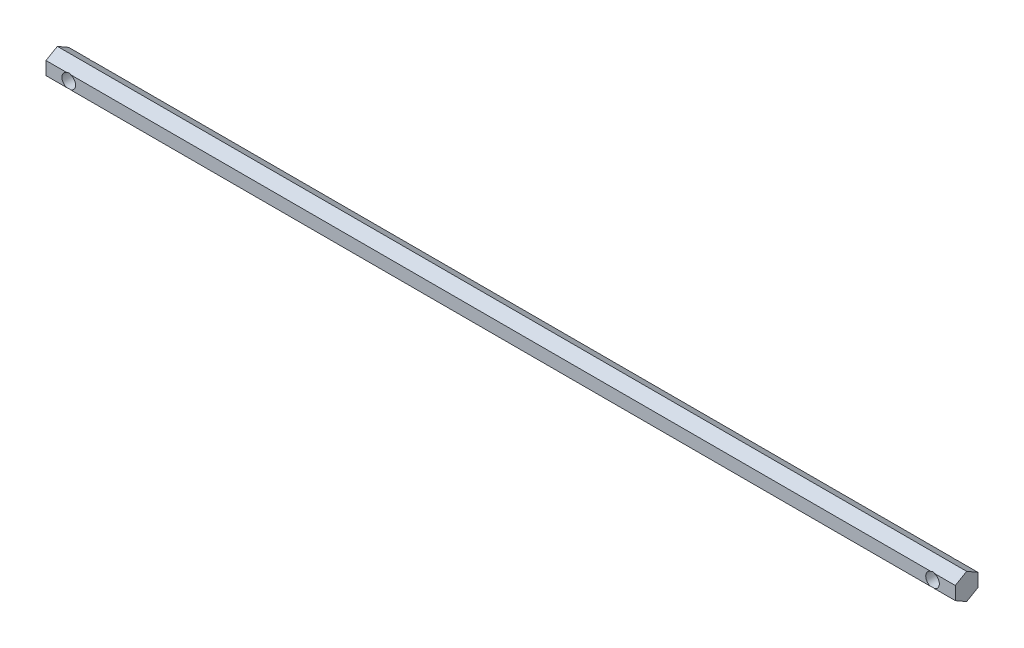
ISO-10303-21;
HEADER;
FILE_DESCRIPTION(('STEP AP214'),'2;1');
FILE_NAME('part.step','',(''),(''),'','','');
FILE_SCHEMA(('AUTOMOTIVE_DESIGN { 1 0 10303 214 1 1 1 1 }'));
ENDSEC;
DATA;
#1=APPLICATION_CONTEXT('core data for automotive mechanical design processes');
#2=APPLICATION_PROTOCOL_DEFINITION('international standard','automotive_design',2000,#1);
#3=PRODUCT_CONTEXT('',#1,'mechanical');
#4=PRODUCT('Part','Part','',(#3));
#5=PRODUCT_RELATED_PRODUCT_CATEGORY('part','',(#4));
#6=PRODUCT_DEFINITION_FORMATION('','',#4);
#7=PRODUCT_DEFINITION_CONTEXT('part definition',#1,'design');
#8=PRODUCT_DEFINITION('design','',#6,#7);
#9=PRODUCT_DEFINITION_SHAPE('','',#8);
#10=(LENGTH_UNIT() NAMED_UNIT(*) SI_UNIT(.MILLI.,.METRE.));
#11=(NAMED_UNIT(*) PLANE_ANGLE_UNIT() SI_UNIT($,.RADIAN.));
#12=(NAMED_UNIT(*) SI_UNIT($,.STERADIAN.) SOLID_ANGLE_UNIT());
#13=UNCERTAINTY_MEASURE_WITH_UNIT(LENGTH_MEASURE(1.E-05),#10,'distance_accuracy_value','');
#14=(GEOMETRIC_REPRESENTATION_CONTEXT(3) GLOBAL_UNCERTAINTY_ASSIGNED_CONTEXT((#13)) GLOBAL_UNIT_ASSIGNED_CONTEXT((#10,
#11,#12)) REPRESENTATION_CONTEXT('',''));
#15=CARTESIAN_POINT('',(0.,0.,0.));
#16=DIRECTION('',(0.,0.,1.));
#17=DIRECTION('',(1.,0.,0.));
#18=AXIS2_PLACEMENT_3D('',#15,#16,#17);
#19=CARTESIAN_POINT('',(200.,2.88675134594811,5.));
#20=DIRECTION('',(0.,0.,-1.));
#21=DIRECTION('',(0.,1.,0.));
#22=AXIS2_PLACEMENT_3D('',#19,#20,#21);
#23=PLANE('',#22);
#24=DIRECTION('',(-1.,0.,0.));
#25=VECTOR('',#24,1.);
#26=CARTESIAN_POINT('',(200.,2.88675134594811,5.));
#27=LINE('',#26,#25);
#28=CARTESIAN_POINT('',(200.,2.88675134594811,5.));
#29=VERTEX_POINT('',#28);
#30=CARTESIAN_POINT('',(190.816496580928,2.88675134594811,5.));
#31=VERTEX_POINT('',#30);
#32=EDGE_CURVE('E182',#29,#31,#27,.T.);
#33=ORIENTED_EDGE('',*,*,#32,.T.);
#34=CARTESIAN_POINT('',(190.,0.,5.));
#35=DIRECTION('',(0.,0.,1.));
#36=DIRECTION('',(1.,0.,0.));
#37=AXIS2_PLACEMENT_3D('',#34,#35,#36);
#38=CIRCLE('',#37,2.99999999999999);
#39=CARTESIAN_POINT('',(190.816496580928,-2.88675134594814,5.));
#40=VERTEX_POINT('',#39);
#41=EDGE_CURVE('E265',#40,#31,#38,.T.);
#42=ORIENTED_EDGE('',*,*,#41,.F.);
#43=DIRECTION('',(-1.,0.,0.));
#44=VECTOR('',#43,1.);
#45=CARTESIAN_POINT('',(200.,-2.88675134594815,4.99999999999998));
#46=LINE('',#45,#44);
#47=CARTESIAN_POINT('',(200.,-2.88675134594815,4.99999999999998));
#48=VERTEX_POINT('',#47);
#49=EDGE_CURVE('E177',#48,#40,#46,.T.);
#50=ORIENTED_EDGE('',*,*,#49,.F.);
#51=DIRECTION('',(0.,-1.,0.));
#52=VECTOR('',#51,1.);
#53=CARTESIAN_POINT('',(200.,2.88675134594811,5.));
#54=LINE('',#53,#52);
#55=EDGE_CURVE('E215',#29,#48,#54,.T.);
#56=ORIENTED_EDGE('',*,*,#55,.F.);
#57=EDGE_LOOP('',(#33,#42,#50,#56));
#58=FACE_BOUND('',#57,.T.);
#59=ADVANCED_FACE('F37',(#58),#23,.F.);
#60=CARTESIAN_POINT('',(189.183503419072,-2.88675134594815,4.99999999999998));
#61=VERTEX_POINT('',#60);
#62=CARTESIAN_POINT('',(-189.183503419072,-2.88675134594814,5.));
#63=VERTEX_POINT('',#62);
#64=EDGE_CURVE('E181',#61,#63,#46,.T.);
#65=ORIENTED_EDGE('',*,*,#64,.F.);
#66=CARTESIAN_POINT('',(189.183503419072,2.88675134594811,5.));
#67=VERTEX_POINT('',#66);
#68=EDGE_CURVE('E60',#67,#61,#38,.T.);
#69=ORIENTED_EDGE('',*,*,#68,.F.);
#70=CARTESIAN_POINT('',(-189.183503419072,2.88675134594811,5.));
#71=VERTEX_POINT('',#70);
#72=EDGE_CURVE('E186',#67,#71,#27,.T.);
#73=ORIENTED_EDGE('',*,*,#72,.T.);
#74=CARTESIAN_POINT('',(-190.,0.,5.));
#75=DIRECTION('',(0.,0.,1.));
#76=DIRECTION('',(1.,0.,0.));
#77=AXIS2_PLACEMENT_3D('',#74,#75,#76);
#78=CIRCLE('',#77,2.99999999999999);
#79=EDGE_CURVE('E272',#63,#71,#78,.T.);
#80=ORIENTED_EDGE('',*,*,#79,.F.);
#81=EDGE_LOOP('',(#65,#69,#73,#80));
#82=FACE_BOUND('',#81,.T.);
#83=ADVANCED_FACE('F271',(#82),#23,.F.);
#84=CARTESIAN_POINT('',(200.,-2.88675134594808,-5.00000000000002));
#85=DIRECTION('',(0.,0.,1.));
#86=DIRECTION('',(0.,-1.,0.));
#87=AXIS2_PLACEMENT_3D('',#84,#85,#86);
#88=PLANE('',#87);
#89=DIRECTION('',(-1.,0.,0.));
#90=VECTOR('',#89,1.);
#91=CARTESIAN_POINT('',(200.,-2.88675134594808,-5.00000000000002));
#92=LINE('',#91,#90);
#93=CARTESIAN_POINT('',(200.,-2.88675134594808,-5.00000000000002));
#94=VERTEX_POINT('',#93);
#95=CARTESIAN_POINT('',(190.816496580928,-2.88675134594808,-5.00000000000002));
#96=VERTEX_POINT('',#95);
#97=EDGE_CURVE('E170',#94,#96,#92,.T.);
#98=ORIENTED_EDGE('',*,*,#97,.T.);
#99=CARTESIAN_POINT('',(190.,0.,-4.99999999999999));
#100=DIRECTION('',(0.,0.,1.));
#101=DIRECTION('',(0.,-1.,0.));
#102=AXIS2_PLACEMENT_3D('',#99,#100,#101);
#103=CIRCLE('',#102,2.99999999999999);
#104=CARTESIAN_POINT('',(190.816496580928,2.88675134594818,-5.00000000000002));
#105=VERTEX_POINT('',#104);
#106=EDGE_CURVE('E11',#96,#105,#103,.T.);
#107=ORIENTED_EDGE('',*,*,#106,.T.);
#108=DIRECTION('',(-1.,0.,0.));
#109=VECTOR('',#108,1.);
#110=CARTESIAN_POINT('',(200.,2.88675134594818,-4.99999999999996));
#111=LINE('',#110,#109);
#112=CARTESIAN_POINT('',(200.,2.88675134594818,-4.99999999999996));
#113=VERTEX_POINT('',#112);
#114=EDGE_CURVE('E161',#113,#105,#111,.T.);
#115=ORIENTED_EDGE('',*,*,#114,.F.);
#116=DIRECTION('',(0.,1.,0.));
#117=VECTOR('',#116,1.);
#118=CARTESIAN_POINT('',(200.,-2.88675134594808,-5.00000000000002));
#119=LINE('',#118,#117);
#120=EDGE_CURVE('E165',#94,#113,#119,.T.);
#121=ORIENTED_EDGE('',*,*,#120,.F.);
#122=EDGE_LOOP('',(#98,#107,#115,#121));
#123=FACE_BOUND('',#122,.T.);
#124=ADVANCED_FACE('F249',(#123),#88,.F.);
#125=CARTESIAN_POINT('',(189.183503419072,2.88675134594818,-5.00000000000002));
#126=VERTEX_POINT('',#125);
#127=CARTESIAN_POINT('',(-189.183503419073,2.88675134594818,-5.00000000000002));
#128=VERTEX_POINT('',#127);
#129=EDGE_CURVE('E155',#126,#128,#111,.T.);
#130=ORIENTED_EDGE('',*,*,#129,.F.);
#131=CARTESIAN_POINT('',(189.183503419072,-2.88675134594808,-5.00000000000002));
#132=VERTEX_POINT('',#131);
#133=EDGE_CURVE('E41',#126,#132,#103,.T.);
#134=ORIENTED_EDGE('',*,*,#133,.T.);
#135=CARTESIAN_POINT('',(-189.183503419072,-2.88675134594808,-5.00000000000002));
#136=VERTEX_POINT('',#135);
#137=EDGE_CURVE('E157',#132,#136,#92,.T.);
#138=ORIENTED_EDGE('',*,*,#137,.T.);
#139=CARTESIAN_POINT('',(-190.,0.,-4.99999999999999));
#140=DIRECTION('',(0.,0.,1.));
#141=DIRECTION('',(0.,-1.,0.));
#142=AXIS2_PLACEMENT_3D('',#139,#140,#141);
#143=CIRCLE('',#142,2.99999999999999);
#144=EDGE_CURVE('E140',#136,#128,#143,.T.);
#145=ORIENTED_EDGE('',*,*,#144,.T.);
#146=EDGE_LOOP('',(#130,#134,#138,#145));
#147=FACE_BOUND('',#146,.T.);
#148=ADVANCED_FACE('F153',(#147),#88,.F.);
#149=CARTESIAN_POINT('',(200.,2.88675134594818,-4.99999999999996));
#150=DIRECTION('',(0.,-0.866025403784442,0.499999999999995));
#151=DIRECTION('',(0.,-0.499999999999995,-0.866025403784442));
#152=AXIS2_PLACEMENT_3D('',#149,#150,#151);
#153=PLANE('',#152);
#154=ORIENTED_EDGE('',*,*,#114,.T.);
#155=CARTESIAN_POINT('',(190.,0.,-10.0000000000001));
#156=DIRECTION('',(0.,-0.866025403784442,0.499999999999995));
#157=DIRECTION('',(0.,0.499999999999995,0.866025403784442));
#158=AXIS2_PLACEMENT_3D('',#155,#156,#157);
#159=ELLIPSE('',#158,6.00000000000005,2.99999999999999);
#160=EDGE_CURVE('E160',#105,#126,#159,.T.);
#161=ORIENTED_EDGE('',*,*,#160,.T.);
#162=ORIENTED_EDGE('',*,*,#129,.T.);
#163=CARTESIAN_POINT('',(-190.,0.,-10.0000000000002));
#164=DIRECTION('',(0.,-0.866025403784442,0.499999999999995));
#165=DIRECTION('',(0.,0.499999999999995,0.866025403784442));
#166=AXIS2_PLACEMENT_3D('',#163,#164,#165);
#167=ELLIPSE('',#166,6.00000000000005,2.99999999999999);
#168=CARTESIAN_POINT('',(-190.816496580927,2.88675134594818,-5.00000000000002));
#169=VERTEX_POINT('',#168);
#170=EDGE_CURVE('E137',#128,#169,#167,.T.);
#171=ORIENTED_EDGE('',*,*,#170,.T.);
#172=CARTESIAN_POINT('',(-200.,2.88675134594818,-4.99999999999996));
#173=VERTEX_POINT('',#172);
#174=EDGE_CURVE('E162',#169,#173,#111,.T.);
#175=ORIENTED_EDGE('',*,*,#174,.T.);
#176=DIRECTION('',(0.,0.499999999999995,0.866025403784441));
#177=VECTOR('',#176,1.);
#178=CARTESIAN_POINT('',(-200.,2.88675134594818,-4.99999999999996));
#179=LINE('',#178,#177);
#180=CARTESIAN_POINT('',(-200.,5.77350269189625,0.));
#181=VERTEX_POINT('',#180);
#182=EDGE_CURVE('E207',#173,#181,#179,.T.);
#183=ORIENTED_EDGE('',*,*,#182,.T.);
#184=DIRECTION('',(-1.,0.,0.));
#185=VECTOR('',#184,1.);
#186=CARTESIAN_POINT('',(200.,5.77350269189625,0.));
#187=LINE('',#186,#185);
#188=CARTESIAN_POINT('',(200.,5.77350269189625,0.));
#189=VERTEX_POINT('',#188);
#190=EDGE_CURVE('E185',#189,#181,#187,.T.);
#191=ORIENTED_EDGE('',*,*,#190,.F.);
#192=DIRECTION('',(0.,0.499999999999995,0.866025403784441));
#193=VECTOR('',#192,1.);
#194=CARTESIAN_POINT('',(200.,2.88675134594818,-4.99999999999996));
#195=LINE('',#194,#193);
#196=EDGE_CURVE('E208',#113,#189,#195,.T.);
#197=ORIENTED_EDGE('',*,*,#196,.F.);
#198=EDGE_LOOP('',(#154,#161,#162,#171,#175,#183,#191,#197));
#199=FACE_BOUND('',#198,.T.);
#200=ADVANCED_FACE('F39',(#199),#153,.F.);
#201=CARTESIAN_POINT('',(200.,5.77350269189625,0.));
#202=DIRECTION('',(0.,-0.866025403784438,-0.500000000000001));
#203=DIRECTION('',(0.,0.500000000000001,-0.866025403784438));
#204=AXIS2_PLACEMENT_3D('',#201,#202,#203);
#205=PLANE('',#204);
#206=ORIENTED_EDGE('',*,*,#72,.F.);
#207=CARTESIAN_POINT('',(190.,0.,9.99999999999995));
#208=DIRECTION('',(0.,-0.866025403784438,-0.500000000000001));
#209=DIRECTION('',(0.,-0.500000000000001,0.866025403784438));
#210=AXIS2_PLACEMENT_3D('',#207,#208,#209);
#211=ELLIPSE('',#210,5.99999999999998,2.99999999999999);
#212=EDGE_CURVE('E256',#67,#31,#211,.T.);
#213=ORIENTED_EDGE('',*,*,#212,.T.);
#214=ORIENTED_EDGE('',*,*,#32,.F.);
#215=DIRECTION('',(0.,-0.500000000000001,0.866025403784438));
#216=VECTOR('',#215,1.);
#217=CARTESIAN_POINT('',(200.,5.77350269189625,0.));
#218=LINE('',#217,#216);
#219=EDGE_CURVE('E210',#189,#29,#218,.T.);
#220=ORIENTED_EDGE('',*,*,#219,.F.);
#221=ORIENTED_EDGE('',*,*,#190,.T.);
#222=DIRECTION('',(0.,-0.500000000000001,0.866025403784438));
#223=VECTOR('',#222,1.);
#224=CARTESIAN_POINT('',(-200.,5.77350269189625,0.));
#225=LINE('',#224,#223);
#226=CARTESIAN_POINT('',(-200.,2.88675134594811,5.));
#227=VERTEX_POINT('',#226);
#228=EDGE_CURVE('E227',#181,#227,#225,.T.);
#229=ORIENTED_EDGE('',*,*,#228,.T.);
#230=CARTESIAN_POINT('',(-190.816496580928,2.88675134594811,5.));
#231=VERTEX_POINT('',#230);
#232=EDGE_CURVE('E180',#231,#227,#27,.T.);
#233=ORIENTED_EDGE('',*,*,#232,.F.);
#234=CARTESIAN_POINT('',(-190.,0.,10.));
#235=DIRECTION('',(0.,-0.866025403784438,-0.500000000000001));
#236=DIRECTION('',(0.,-0.500000000000001,0.866025403784438));
#237=AXIS2_PLACEMENT_3D('',#234,#235,#236);
#238=ELLIPSE('',#237,5.99999999999998,2.99999999999999);
#239=EDGE_CURVE('E148',#231,#71,#238,.T.);
#240=ORIENTED_EDGE('',*,*,#239,.T.);
#241=EDGE_LOOP('',(#206,#213,#214,#220,#221,#229,#233,#240));
#242=FACE_BOUND('',#241,.T.);
#243=ADVANCED_FACE('F244',(#242),#205,.F.);
#244=CARTESIAN_POINT('',(-190.816496580928,-2.88675134594815,4.99999999999998));
#245=VERTEX_POINT('',#244);
#246=CARTESIAN_POINT('',(-200.,-2.88675134594815,4.99999999999998));
#247=VERTEX_POINT('',#246);
#248=EDGE_CURVE('E176',#245,#247,#46,.T.);
#249=ORIENTED_EDGE('',*,*,#248,.F.);
#250=EDGE_CURVE('E52',#231,#245,#78,.T.);
#251=ORIENTED_EDGE('',*,*,#250,.F.);
#252=ORIENTED_EDGE('',*,*,#232,.T.);
#253=DIRECTION('',(0.,-1.,0.));
#254=VECTOR('',#253,1.);
#255=CARTESIAN_POINT('',(-200.,2.88675134594811,5.));
#256=LINE('',#255,#254);
#257=EDGE_CURVE('E230',#227,#247,#256,.T.);
#258=ORIENTED_EDGE('',*,*,#257,.T.);
#259=EDGE_LOOP('',(#249,#251,#252,#258));
#260=FACE_BOUND('',#259,.T.);
#261=ADVANCED_FACE('F239',(#260),#23,.F.);
#262=CARTESIAN_POINT('',(200.,-2.88675134594815,4.99999999999998));
#263=DIRECTION('',(0.,0.866025403784442,-0.499999999999995));
#264=DIRECTION('',(0.,0.499999999999995,0.866025403784442));
#265=AXIS2_PLACEMENT_3D('',#262,#263,#264);
#266=PLANE('',#265);
#267=ORIENTED_EDGE('',*,*,#49,.T.);
#268=CARTESIAN_POINT('',(190.,0.,10.0000000000001));
#269=DIRECTION('',(0.,0.866025403784442,-0.499999999999995));
#270=DIRECTION('',(0.,0.499999999999995,0.866025403784442));
#271=AXIS2_PLACEMENT_3D('',#268,#269,#270);
#272=ELLIPSE('',#271,6.00000000000005,2.99999999999999);
#273=EDGE_CURVE('E254',#40,#61,#272,.T.);
#274=ORIENTED_EDGE('',*,*,#273,.T.);
#275=ORIENTED_EDGE('',*,*,#64,.T.);
#276=CARTESIAN_POINT('',(-190.,0.,10.));
#277=DIRECTION('',(0.,0.866025403784442,-0.499999999999995));
#278=DIRECTION('',(0.,0.499999999999995,0.866025403784442));
#279=AXIS2_PLACEMENT_3D('',#276,#277,#278);
#280=ELLIPSE('',#279,6.00000000000005,2.99999999999999);
#281=EDGE_CURVE('E277',#63,#245,#280,.T.);
#282=ORIENTED_EDGE('',*,*,#281,.T.);
#283=ORIENTED_EDGE('',*,*,#248,.T.);
#284=DIRECTION('',(0.,-0.499999999999995,-0.866025403784441));
#285=VECTOR('',#284,1.);
#286=CARTESIAN_POINT('',(-200.,-2.88675134594815,4.99999999999998));
#287=LINE('',#286,#285);
#288=CARTESIAN_POINT('',(-200.,-5.77350269189625,0.));
#289=VERTEX_POINT('',#288);
#290=EDGE_CURVE('E203',#247,#289,#287,.T.);
#291=ORIENTED_EDGE('',*,*,#290,.T.);
#292=DIRECTION('',(-1.,0.,0.));
#293=VECTOR('',#292,1.);
#294=CARTESIAN_POINT('',(200.,-5.77350269189625,0.));
#295=LINE('',#294,#293);
#296=CARTESIAN_POINT('',(200.,-5.77350269189625,0.));
#297=VERTEX_POINT('',#296);
#298=EDGE_CURVE('E173',#297,#289,#295,.T.);
#299=ORIENTED_EDGE('',*,*,#298,.F.);
#300=DIRECTION('',(0.,-0.499999999999995,-0.866025403784441));
#301=VECTOR('',#300,1.);
#302=CARTESIAN_POINT('',(200.,-2.88675134594815,4.99999999999998));
#303=LINE('',#302,#301);
#304=EDGE_CURVE('E221',#48,#297,#303,.T.);
#305=ORIENTED_EDGE('',*,*,#304,.F.);
#306=EDGE_LOOP('',(#267,#274,#275,#282,#283,#291,#299,#305));
#307=FACE_BOUND('',#306,.T.);
#308=ADVANCED_FACE('F234',(#307),#266,.F.);
#309=CARTESIAN_POINT('',(200.,-5.77350269189625,0.));
#310=DIRECTION('',(0.,0.866025403784435,0.500000000000007));
#311=DIRECTION('',(0.,-0.500000000000007,0.866025403784435));
#312=AXIS2_PLACEMENT_3D('',#309,#310,#311);
#313=PLANE('',#312);
#314=ORIENTED_EDGE('',*,*,#137,.F.);
#315=CARTESIAN_POINT('',(190.,0.,-9.99999999999985));
#316=DIRECTION('',(0.,0.866025403784435,0.500000000000007));
#317=DIRECTION('',(0.,-0.500000000000007,0.866025403784435));
#318=AXIS2_PLACEMENT_3D('',#315,#316,#317);
#319=ELLIPSE('',#318,5.99999999999991,2.99999999999999);
#320=EDGE_CURVE('E147',#132,#96,#319,.T.);
#321=ORIENTED_EDGE('',*,*,#320,.T.);
#322=ORIENTED_EDGE('',*,*,#97,.F.);
#323=DIRECTION('',(0.,0.500000000000007,-0.866025403784435));
#324=VECTOR('',#323,1.);
#325=CARTESIAN_POINT('',(200.,-5.77350269189625,0.));
#326=LINE('',#325,#324);
#327=EDGE_CURVE('E223',#297,#94,#326,.T.);
#328=ORIENTED_EDGE('',*,*,#327,.F.);
#329=ORIENTED_EDGE('',*,*,#298,.T.);
#330=DIRECTION('',(0.,0.500000000000007,-0.866025403784435));
#331=VECTOR('',#330,1.);
#332=CARTESIAN_POINT('',(-200.,-5.77350269189625,0.));
#333=LINE('',#332,#331);
#334=CARTESIAN_POINT('',(-200.,-2.88675134594808,-5.00000000000002));
#335=VERTEX_POINT('',#334);
#336=EDGE_CURVE('E197',#289,#335,#333,.T.);
#337=ORIENTED_EDGE('',*,*,#336,.T.);
#338=CARTESIAN_POINT('',(-190.816496580928,-2.88675134594808,-5.00000000000002));
#339=VERTEX_POINT('',#338);
#340=EDGE_CURVE('E164',#339,#335,#92,.T.);
#341=ORIENTED_EDGE('',*,*,#340,.F.);
#342=CARTESIAN_POINT('',(-190.,0.,-9.99999999999977));
#343=DIRECTION('',(0.,0.866025403784435,0.500000000000007));
#344=DIRECTION('',(0.,-0.500000000000007,0.866025403784435));
#345=AXIS2_PLACEMENT_3D('',#342,#343,#344);
#346=ELLIPSE('',#345,5.99999999999991,2.99999999999999);
#347=EDGE_CURVE('E195',#339,#136,#346,.T.);
#348=ORIENTED_EDGE('',*,*,#347,.T.);
#349=EDGE_LOOP('',(#314,#321,#322,#328,#329,#337,#341,#348));
#350=FACE_BOUND('',#349,.T.);
#351=ADVANCED_FACE('F194',(#350),#313,.F.);
#352=ORIENTED_EDGE('',*,*,#174,.F.);
#353=EDGE_CURVE('E143',#169,#339,#143,.T.);
#354=ORIENTED_EDGE('',*,*,#353,.T.);
#355=ORIENTED_EDGE('',*,*,#340,.T.);
#356=DIRECTION('',(0.,1.,0.));
#357=VECTOR('',#356,1.);
#358=CARTESIAN_POINT('',(-200.,-2.88675134594808,-5.00000000000002));
#359=LINE('',#358,#357);
#360=EDGE_CURVE('E168',#335,#173,#359,.T.);
#361=ORIENTED_EDGE('',*,*,#360,.T.);
#362=EDGE_LOOP('',(#352,#354,#355,#361));
#363=FACE_BOUND('',#362,.T.);
#364=ADVANCED_FACE('F190',(#363),#88,.F.);
#365=CARTESIAN_POINT('',(200.,0.,0.));
#366=DIRECTION('',(1.,0.,0.));
#367=DIRECTION('',(0.,0.,-1.));
#368=AXIS2_PLACEMENT_3D('',#365,#366,#367);
#369=PLANE('',#368);
#370=ORIENTED_EDGE('',*,*,#196,.T.);
#371=ORIENTED_EDGE('',*,*,#219,.T.);
#372=ORIENTED_EDGE('',*,*,#55,.T.);
#373=ORIENTED_EDGE('',*,*,#304,.T.);
#374=ORIENTED_EDGE('',*,*,#327,.T.);
#375=ORIENTED_EDGE('',*,*,#120,.T.);
#376=EDGE_LOOP('',(#370,#371,#372,#373,#374,#375));
#377=FACE_BOUND('',#376,.T.);
#378=ADVANCED_FACE('F266',(#377),#369,.T.);
#379=CARTESIAN_POINT('',(-200.,0.,0.));
#380=DIRECTION('',(1.,0.,0.));
#381=DIRECTION('',(0.,0.,-1.));
#382=AXIS2_PLACEMENT_3D('',#379,#380,#381);
#383=PLANE('',#382);
#384=ORIENTED_EDGE('',*,*,#182,.F.);
#385=ORIENTED_EDGE('',*,*,#360,.F.);
#386=ORIENTED_EDGE('',*,*,#336,.F.);
#387=ORIENTED_EDGE('',*,*,#290,.F.);
#388=ORIENTED_EDGE('',*,*,#257,.F.);
#389=ORIENTED_EDGE('',*,*,#228,.F.);
#390=EDGE_LOOP('',(#384,#385,#386,#387,#388,#389));
#391=FACE_BOUND('',#390,.T.);
#392=ADVANCED_FACE('F205',(#391),#383,.F.);
#393=CARTESIAN_POINT('',(-190.,0.,-5.00000000000002));
#394=DIRECTION('',(0.,0.,1.));
#395=DIRECTION('',(1.,0.,0.));
#396=AXIS2_PLACEMENT_3D('',#393,#394,#395);
#397=CYLINDRICAL_SURFACE('',#396,2.99999999999999);
#398=ORIENTED_EDGE('',*,*,#250,.T.);
#399=ORIENTED_EDGE('',*,*,#281,.F.);
#400=ORIENTED_EDGE('',*,*,#79,.T.);
#401=ORIENTED_EDGE('',*,*,#239,.F.);
#402=EDGE_LOOP('',(#398,#399,#400,#401));
#403=FACE_BOUND('',#402,.T.);
#404=ORIENTED_EDGE('',*,*,#144,.F.);
#405=ORIENTED_EDGE('',*,*,#347,.F.);
#406=ORIENTED_EDGE('',*,*,#353,.F.);
#407=ORIENTED_EDGE('',*,*,#170,.F.);
#408=EDGE_LOOP('',(#404,#405,#406,#407));
#409=FACE_BOUND('',#408,.T.);
#410=ADVANCED_FACE('F139',(#403,#409),#397,.F.);
#411=CARTESIAN_POINT('',(190.,0.,-5.00000000000002));
#412=DIRECTION('',(0.,0.,1.));
#413=DIRECTION('',(1.,0.,0.));
#414=AXIS2_PLACEMENT_3D('',#411,#412,#413);
#415=CYLINDRICAL_SURFACE('',#414,2.99999999999999);
#416=ORIENTED_EDGE('',*,*,#68,.T.);
#417=ORIENTED_EDGE('',*,*,#273,.F.);
#418=ORIENTED_EDGE('',*,*,#41,.T.);
#419=ORIENTED_EDGE('',*,*,#212,.F.);
#420=EDGE_LOOP('',(#416,#417,#418,#419));
#421=FACE_BOUND('',#420,.T.);
#422=ORIENTED_EDGE('',*,*,#106,.F.);
#423=ORIENTED_EDGE('',*,*,#320,.F.);
#424=ORIENTED_EDGE('',*,*,#133,.F.);
#425=ORIENTED_EDGE('',*,*,#160,.F.);
#426=EDGE_LOOP('',(#422,#423,#424,#425));
#427=FACE_BOUND('',#426,.T.);
#428=ADVANCED_FACE('F253',(#421,#427),#415,.F.);
#429=CLOSED_SHELL('',(#59,#83,#124,#148,#200,#243,#261,#308,#351,#364,#378,#392,#410,#428));
#430=MANIFOLD_SOLID_BREP('B2',#429);
#431=ADVANCED_BREP_SHAPE_REPRESENTATION('',(#18,#430),#14);
#432=SHAPE_DEFINITION_REPRESENTATION(#9,#431);
ENDSEC;
END-ISO-10303-21;
